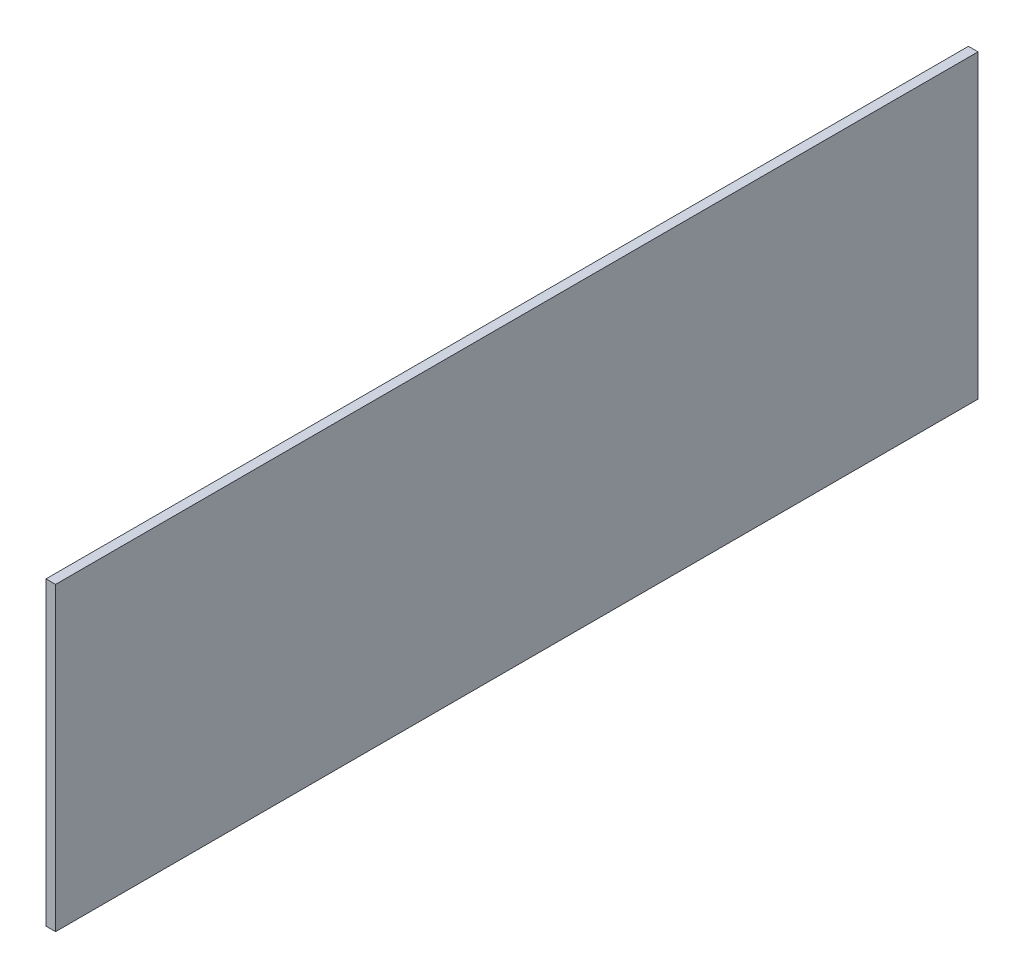
ISO-10303-21;
HEADER;
FILE_DESCRIPTION(('STEP AP214'),'2;1');
FILE_NAME('part.step','',(''),(''),'','','');
FILE_SCHEMA(('AUTOMOTIVE_DESIGN { 1 0 10303 214 1 1 1 1 }'));
ENDSEC;
DATA;
#1=APPLICATION_CONTEXT('core data for automotive mechanical design processes');
#2=APPLICATION_PROTOCOL_DEFINITION('international standard','automotive_design',2000,#1);
#3=PRODUCT_CONTEXT('',#1,'mechanical');
#4=PRODUCT('Part','Part','',(#3));
#5=PRODUCT_RELATED_PRODUCT_CATEGORY('part','',(#4));
#6=PRODUCT_DEFINITION_FORMATION('','',#4);
#7=PRODUCT_DEFINITION_CONTEXT('part definition',#1,'design');
#8=PRODUCT_DEFINITION('design','',#6,#7);
#9=PRODUCT_DEFINITION_SHAPE('','',#8);
#10=(LENGTH_UNIT() NAMED_UNIT(*) SI_UNIT(.MILLI.,.METRE.));
#11=(NAMED_UNIT(*) PLANE_ANGLE_UNIT() SI_UNIT($,.RADIAN.));
#12=(NAMED_UNIT(*) SI_UNIT($,.STERADIAN.) SOLID_ANGLE_UNIT());
#13=UNCERTAINTY_MEASURE_WITH_UNIT(LENGTH_MEASURE(1.E-05),#10,'distance_accuracy_value','');
#14=(GEOMETRIC_REPRESENTATION_CONTEXT(3) GLOBAL_UNCERTAINTY_ASSIGNED_CONTEXT((#13)) GLOBAL_UNIT_ASSIGNED_CONTEXT((#10,
#11,#12)) REPRESENTATION_CONTEXT('',''));
#15=CARTESIAN_POINT('',(0.,0.,0.));
#16=DIRECTION('',(0.,0.,1.));
#17=DIRECTION('',(1.,0.,0.));
#18=AXIS2_PLACEMENT_3D('',#15,#16,#17);
#19=CARTESIAN_POINT('',(3.03,-60.9600000000001,-104.775));
#20=DIRECTION('',(0.,-1.,0.));
#21=DIRECTION('',(0.,0.,-1.));
#22=AXIS2_PLACEMENT_3D('',#19,#20,#21);
#23=PLANE('',#22);
#24=DIRECTION('',(0.,0.,1.));
#25=VECTOR('',#24,1.);
#26=CARTESIAN_POINT('',(0.,-60.9600000000001,-104.775));
#27=LINE('',#26,#25);
#28=CARTESIAN_POINT('',(0.,-60.9600000000001,-104.775));
#29=VERTEX_POINT('',#28);
#30=CARTESIAN_POINT('',(0.,-60.9600000000001,187.325));
#31=VERTEX_POINT('',#30);
#32=EDGE_CURVE('E114',#29,#31,#27,.T.);
#33=ORIENTED_EDGE('',*,*,#32,.F.);
#34=DIRECTION('',(-1.,0.,0.));
#35=VECTOR('',#34,1.);
#36=CARTESIAN_POINT('',(3.03,-60.9600000000001,-104.775));
#37=LINE('',#36,#35);
#38=CARTESIAN_POINT('',(3.03,-60.9600000000001,-104.775));
#39=VERTEX_POINT('',#38);
#40=EDGE_CURVE('E11',#39,#29,#37,.T.);
#41=ORIENTED_EDGE('',*,*,#40,.F.);
#42=DIRECTION('',(0.,0.,1.));
#43=VECTOR('',#42,1.);
#44=CARTESIAN_POINT('',(3.03,-60.9600000000001,-104.775));
#45=LINE('',#44,#43);
#46=CARTESIAN_POINT('',(3.03,-60.9600000000001,187.325));
#47=VERTEX_POINT('',#46);
#48=EDGE_CURVE('E106',#39,#47,#45,.T.);
#49=ORIENTED_EDGE('',*,*,#48,.T.);
#50=DIRECTION('',(-1.,0.,0.));
#51=VECTOR('',#50,1.);
#52=CARTESIAN_POINT('',(3.03,-60.9600000000001,187.325));
#53=LINE('',#52,#51);
#54=EDGE_CURVE('E46',#47,#31,#53,.T.);
#55=ORIENTED_EDGE('',*,*,#54,.T.);
#56=EDGE_LOOP('',(#33,#41,#49,#55));
#57=FACE_BOUND('',#56,.T.);
#58=ADVANCED_FACE('F43',(#57),#23,.T.);
#59=CARTESIAN_POINT('',(3.03,-60.9600000000001,-104.775));
#60=DIRECTION('',(0.,0.,1.));
#61=DIRECTION('',(1.,0.,0.));
#62=AXIS2_PLACEMENT_3D('',#59,#60,#61);
#63=PLANE('',#62);
#64=DIRECTION('',(0.,1.,0.));
#65=VECTOR('',#64,1.);
#66=CARTESIAN_POINT('',(0.,-60.9600000000001,-104.775));
#67=LINE('',#66,#65);
#68=CARTESIAN_POINT('',(0.,34.2899999999999,-104.775));
#69=VERTEX_POINT('',#68);
#70=EDGE_CURVE('E109',#29,#69,#67,.T.);
#71=ORIENTED_EDGE('',*,*,#70,.T.);
#72=DIRECTION('',(-1.,0.,0.));
#73=VECTOR('',#72,1.);
#74=CARTESIAN_POINT('',(3.03,34.2899999999999,-104.775));
#75=LINE('',#74,#73);
#76=CARTESIAN_POINT('',(3.03,34.2899999999999,-104.775));
#77=VERTEX_POINT('',#76);
#78=EDGE_CURVE('E53',#77,#69,#75,.T.);
#79=ORIENTED_EDGE('',*,*,#78,.F.);
#80=DIRECTION('',(0.,1.,0.));
#81=VECTOR('',#80,1.);
#82=CARTESIAN_POINT('',(3.03,-60.9600000000001,-104.775));
#83=LINE('',#82,#81);
#84=EDGE_CURVE('E101',#39,#77,#83,.T.);
#85=ORIENTED_EDGE('',*,*,#84,.F.);
#86=ORIENTED_EDGE('',*,*,#40,.T.);
#87=EDGE_LOOP('',(#71,#79,#85,#86));
#88=FACE_BOUND('',#87,.T.);
#89=ADVANCED_FACE('F129',(#88),#63,.F.);
#90=CARTESIAN_POINT('',(3.03,34.2899999999999,187.325));
#91=DIRECTION('',(0.,1.,0.));
#92=DIRECTION('',(0.,0.,1.));
#93=AXIS2_PLACEMENT_3D('',#90,#91,#92);
#94=PLANE('',#93);
#95=DIRECTION('',(0.,0.,-1.));
#96=VECTOR('',#95,1.);
#97=CARTESIAN_POINT('',(0.,34.2899999999999,187.325));
#98=LINE('',#97,#96);
#99=CARTESIAN_POINT('',(0.,34.2899999999999,187.325));
#100=VERTEX_POINT('',#99);
#101=EDGE_CURVE('E94',#100,#69,#98,.T.);
#102=ORIENTED_EDGE('',*,*,#101,.F.);
#103=DIRECTION('',(-1.,0.,0.));
#104=VECTOR('',#103,1.);
#105=CARTESIAN_POINT('',(3.03,34.2899999999999,187.325));
#106=LINE('',#105,#104);
#107=CARTESIAN_POINT('',(3.03,34.2899999999999,187.325));
#108=VERTEX_POINT('',#107);
#109=EDGE_CURVE('E89',#108,#100,#106,.T.);
#110=ORIENTED_EDGE('',*,*,#109,.F.);
#111=DIRECTION('',(0.,0.,-1.));
#112=VECTOR('',#111,1.);
#113=CARTESIAN_POINT('',(3.03,34.2899999999999,187.325));
#114=LINE('',#113,#112);
#115=EDGE_CURVE('E92',#108,#77,#114,.T.);
#116=ORIENTED_EDGE('',*,*,#115,.T.);
#117=ORIENTED_EDGE('',*,*,#78,.T.);
#118=EDGE_LOOP('',(#102,#110,#116,#117));
#119=FACE_BOUND('',#118,.T.);
#120=ADVANCED_FACE('F91',(#119),#94,.T.);
#121=CARTESIAN_POINT('',(3.03,-60.9600000000001,187.325));
#122=DIRECTION('',(0.,0.,1.));
#123=DIRECTION('',(1.,0.,0.));
#124=AXIS2_PLACEMENT_3D('',#121,#122,#123);
#125=PLANE('',#124);
#126=DIRECTION('',(0.,1.,0.));
#127=VECTOR('',#126,1.);
#128=CARTESIAN_POINT('',(0.,-60.9600000000001,187.325));
#129=LINE('',#128,#127);
#130=EDGE_CURVE('E118',#31,#100,#129,.T.);
#131=ORIENTED_EDGE('',*,*,#130,.F.);
#132=ORIENTED_EDGE('',*,*,#54,.F.);
#133=DIRECTION('',(0.,1.,0.));
#134=VECTOR('',#133,1.);
#135=CARTESIAN_POINT('',(3.03,-60.9600000000001,187.325));
#136=LINE('',#135,#134);
#137=EDGE_CURVE('E100',#47,#108,#136,.T.);
#138=ORIENTED_EDGE('',*,*,#137,.T.);
#139=ORIENTED_EDGE('',*,*,#109,.T.);
#140=EDGE_LOOP('',(#131,#132,#138,#139));
#141=FACE_BOUND('',#140,.T.);
#142=ADVANCED_FACE('F104',(#141),#125,.T.);
#143=CARTESIAN_POINT('',(3.03,0.,0.));
#144=DIRECTION('',(-1.,0.,0.));
#145=DIRECTION('',(0.,0.,1.));
#146=AXIS2_PLACEMENT_3D('',#143,#144,#145);
#147=PLANE('',#146);
#148=ORIENTED_EDGE('',*,*,#48,.F.);
#149=ORIENTED_EDGE('',*,*,#84,.T.);
#150=ORIENTED_EDGE('',*,*,#115,.F.);
#151=ORIENTED_EDGE('',*,*,#137,.F.);
#152=EDGE_LOOP('',(#148,#149,#150,#151));
#153=FACE_BOUND('',#152,.T.);
#154=ADVANCED_FACE('F99',(#153),#147,.F.);
#155=CARTESIAN_POINT('',(0.,0.,0.));
#156=DIRECTION('',(-1.,0.,0.));
#157=DIRECTION('',(0.,0.,1.));
#158=AXIS2_PLACEMENT_3D('',#155,#156,#157);
#159=PLANE('',#158);
#160=ORIENTED_EDGE('',*,*,#32,.T.);
#161=ORIENTED_EDGE('',*,*,#130,.T.);
#162=ORIENTED_EDGE('',*,*,#101,.T.);
#163=ORIENTED_EDGE('',*,*,#70,.F.);
#164=EDGE_LOOP('',(#160,#161,#162,#163));
#165=FACE_BOUND('',#164,.T.);
#166=ADVANCED_FACE('F128',(#165),#159,.T.);
#167=CLOSED_SHELL('',(#58,#89,#120,#142,#154,#166));
#168=MANIFOLD_SOLID_BREP('B2',#167);
#169=ADVANCED_BREP_SHAPE_REPRESENTATION('',(#18,#168),#14);
#170=SHAPE_DEFINITION_REPRESENTATION(#9,#169);
ENDSEC;
END-ISO-10303-21;
